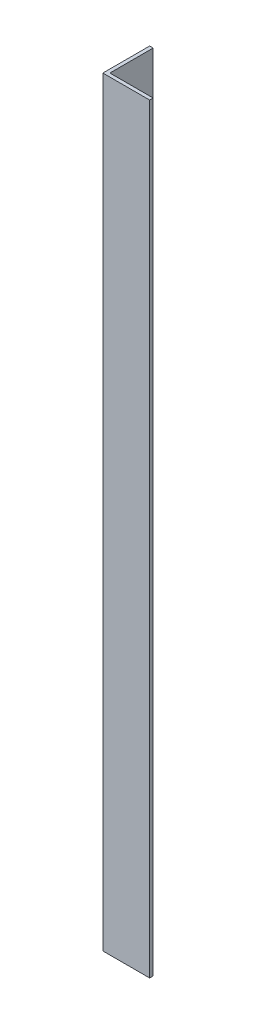
ISO-10303-21;
HEADER;
FILE_DESCRIPTION(('STEP AP214'),'2;1');
FILE_NAME('part.step','',(''),(''),'','','');
FILE_SCHEMA(('AUTOMOTIVE_DESIGN { 1 0 10303 214 1 1 1 1 }'));
ENDSEC;
DATA;
#1=APPLICATION_CONTEXT('core data for automotive mechanical design processes');
#2=APPLICATION_PROTOCOL_DEFINITION('international standard','automotive_design',2000,#1);
#3=PRODUCT_CONTEXT('',#1,'mechanical');
#4=PRODUCT('Part','Part','',(#3));
#5=PRODUCT_RELATED_PRODUCT_CATEGORY('part','',(#4));
#6=PRODUCT_DEFINITION_FORMATION('','',#4);
#7=PRODUCT_DEFINITION_CONTEXT('part definition',#1,'design');
#8=PRODUCT_DEFINITION('design','',#6,#7);
#9=PRODUCT_DEFINITION_SHAPE('','',#8);
#10=(LENGTH_UNIT() NAMED_UNIT(*) SI_UNIT(.MILLI.,.METRE.));
#11=(NAMED_UNIT(*) PLANE_ANGLE_UNIT() SI_UNIT($,.RADIAN.));
#12=(NAMED_UNIT(*) SI_UNIT($,.STERADIAN.) SOLID_ANGLE_UNIT());
#13=UNCERTAINTY_MEASURE_WITH_UNIT(LENGTH_MEASURE(1.E-05),#10,'distance_accuracy_value','');
#14=(GEOMETRIC_REPRESENTATION_CONTEXT(3) GLOBAL_UNCERTAINTY_ASSIGNED_CONTEXT((#13)) GLOBAL_UNIT_ASSIGNED_CONTEXT((#10,
#11,#12)) REPRESENTATION_CONTEXT('',''));
#15=CARTESIAN_POINT('',(0.,0.,0.));
#16=DIRECTION('',(0.,0.,1.));
#17=DIRECTION('',(1.,0.,0.));
#18=AXIS2_PLACEMENT_3D('',#15,#16,#17);
#19=CARTESIAN_POINT('',(0.,650.,0.));
#20=DIRECTION('',(0.,0.,-1.));
#21=DIRECTION('',(-1.,0.,0.));
#22=AXIS2_PLACEMENT_3D('',#19,#20,#21);
#23=PLANE('',#22);
#24=DIRECTION('',(1.,0.,0.));
#25=VECTOR('',#24,1.);
#26=CARTESIAN_POINT('',(0.,0.,0.));
#27=LINE('',#26,#25);
#28=CARTESIAN_POINT('',(0.,0.,0.));
#29=VERTEX_POINT('',#28);
#30=CARTESIAN_POINT('',(40.,0.,0.));
#31=VERTEX_POINT('',#30);
#32=EDGE_CURVE('E115',#29,#31,#27,.T.);
#33=ORIENTED_EDGE('',*,*,#32,.T.);
#34=DIRECTION('',(0.,-1.,0.));
#35=VECTOR('',#34,1.);
#36=CARTESIAN_POINT('',(40.,650.,0.));
#37=LINE('',#36,#35);
#38=CARTESIAN_POINT('',(40.,650.,0.));
#39=VERTEX_POINT('',#38);
#40=EDGE_CURVE('E11',#39,#31,#37,.T.);
#41=ORIENTED_EDGE('',*,*,#40,.F.);
#42=DIRECTION('',(1.,0.,0.));
#43=VECTOR('',#42,1.);
#44=CARTESIAN_POINT('',(0.,650.,0.));
#45=LINE('',#44,#43);
#46=CARTESIAN_POINT('',(0.,650.,0.));
#47=VERTEX_POINT('',#46);
#48=EDGE_CURVE('E80',#47,#39,#45,.T.);
#49=ORIENTED_EDGE('',*,*,#48,.F.);
#50=DIRECTION('',(0.,-1.,0.));
#51=VECTOR('',#50,1.);
#52=CARTESIAN_POINT('',(0.,650.,0.));
#53=LINE('',#52,#51);
#54=EDGE_CURVE('E111',#47,#29,#53,.T.);
#55=ORIENTED_EDGE('',*,*,#54,.T.);
#56=EDGE_LOOP('',(#33,#41,#49,#55));
#57=FACE_BOUND('',#56,.T.);
#58=ADVANCED_FACE('F34',(#57),#23,.F.);
#59=CARTESIAN_POINT('',(40.,650.,-3.));
#60=DIRECTION('',(1.,0.,0.));
#61=DIRECTION('',(0.,0.,-1.));
#62=AXIS2_PLACEMENT_3D('',#59,#60,#61);
#63=PLANE('',#62);
#64=DIRECTION('',(0.,0.,1.));
#65=VECTOR('',#64,1.);
#66=CARTESIAN_POINT('',(40.,0.,-3.));
#67=LINE('',#66,#65);
#68=CARTESIAN_POINT('',(40.,0.,-3.));
#69=VERTEX_POINT('',#68);
#70=EDGE_CURVE('E118',#69,#31,#67,.T.);
#71=ORIENTED_EDGE('',*,*,#70,.F.);
#72=DIRECTION('',(0.,-1.,0.));
#73=VECTOR('',#72,1.);
#74=CARTESIAN_POINT('',(40.,650.,-3.));
#75=LINE('',#74,#73);
#76=CARTESIAN_POINT('',(40.,650.,-3.));
#77=VERTEX_POINT('',#76);
#78=EDGE_CURVE('E42',#77,#69,#75,.T.);
#79=ORIENTED_EDGE('',*,*,#78,.F.);
#80=DIRECTION('',(0.,0.,1.));
#81=VECTOR('',#80,1.);
#82=CARTESIAN_POINT('',(40.,650.,-3.));
#83=LINE('',#82,#81);
#84=EDGE_CURVE('E204',#77,#39,#83,.T.);
#85=ORIENTED_EDGE('',*,*,#84,.T.);
#86=ORIENTED_EDGE('',*,*,#40,.T.);
#87=EDGE_LOOP('',(#71,#79,#85,#86));
#88=FACE_BOUND('',#87,.T.);
#89=ADVANCED_FACE('F136',(#88),#63,.T.);
#90=CARTESIAN_POINT('',(0.,650.,-3.));
#91=DIRECTION('',(0.,0.,-1.));
#92=DIRECTION('',(-1.,0.,0.));
#93=AXIS2_PLACEMENT_3D('',#90,#91,#92);
#94=PLANE('',#93);
#95=DIRECTION('',(1.,0.,0.));
#96=VECTOR('',#95,1.);
#97=CARTESIAN_POINT('',(0.,0.,-3.));
#98=LINE('',#97,#96);
#99=CARTESIAN_POINT('',(3.,0.,-3.));
#100=VERTEX_POINT('',#99);
#101=EDGE_CURVE('E121',#100,#69,#98,.T.);
#102=ORIENTED_EDGE('',*,*,#101,.F.);
#103=DIRECTION('',(0.,-1.,0.));
#104=VECTOR('',#103,1.);
#105=CARTESIAN_POINT('',(3.,650.,-3.));
#106=LINE('',#105,#104);
#107=CARTESIAN_POINT('',(3.,650.,-3.));
#108=VERTEX_POINT('',#107);
#109=EDGE_CURVE('E101',#108,#100,#106,.T.);
#110=ORIENTED_EDGE('',*,*,#109,.F.);
#111=DIRECTION('',(1.,0.,0.));
#112=VECTOR('',#111,1.);
#113=CARTESIAN_POINT('',(0.,650.,-3.));
#114=LINE('',#113,#112);
#115=EDGE_CURVE('E107',#108,#77,#114,.T.);
#116=ORIENTED_EDGE('',*,*,#115,.T.);
#117=ORIENTED_EDGE('',*,*,#78,.T.);
#118=EDGE_LOOP('',(#102,#110,#116,#117));
#119=FACE_BOUND('',#118,.T.);
#120=ADVANCED_FACE('F133',(#119),#94,.T.);
#121=CARTESIAN_POINT('',(3.,650.,-40.));
#122=DIRECTION('',(1.,0.,0.));
#123=DIRECTION('',(0.,0.,-1.));
#124=AXIS2_PLACEMENT_3D('',#121,#122,#123);
#125=PLANE('',#124);
#126=DIRECTION('',(0.,0.,1.));
#127=VECTOR('',#126,1.);
#128=CARTESIAN_POINT('',(3.,0.,-40.));
#129=LINE('',#128,#127);
#130=CARTESIAN_POINT('',(3.,0.,-40.));
#131=VERTEX_POINT('',#130);
#132=EDGE_CURVE('E96',#131,#100,#129,.T.);
#133=ORIENTED_EDGE('',*,*,#132,.F.);
#134=DIRECTION('',(0.,-1.,0.));
#135=VECTOR('',#134,1.);
#136=CARTESIAN_POINT('',(3.,650.,-40.));
#137=LINE('',#136,#135);
#138=CARTESIAN_POINT('',(3.,650.,-40.));
#139=VERTEX_POINT('',#138);
#140=EDGE_CURVE('E91',#139,#131,#137,.T.);
#141=ORIENTED_EDGE('',*,*,#140,.F.);
#142=DIRECTION('',(0.,0.,1.));
#143=VECTOR('',#142,1.);
#144=CARTESIAN_POINT('',(3.,650.,-40.));
#145=LINE('',#144,#143);
#146=EDGE_CURVE('E94',#139,#108,#145,.T.);
#147=ORIENTED_EDGE('',*,*,#146,.T.);
#148=ORIENTED_EDGE('',*,*,#109,.T.);
#149=EDGE_LOOP('',(#133,#141,#147,#148));
#150=FACE_BOUND('',#149,.T.);
#151=ADVANCED_FACE('F93',(#150),#125,.T.);
#152=CARTESIAN_POINT('',(0.,650.,-40.));
#153=DIRECTION('',(0.,0.,-1.));
#154=DIRECTION('',(-1.,0.,0.));
#155=AXIS2_PLACEMENT_3D('',#152,#153,#154);
#156=PLANE('',#155);
#157=DIRECTION('',(1.,0.,0.));
#158=VECTOR('',#157,1.);
#159=CARTESIAN_POINT('',(0.,0.,-40.));
#160=LINE('',#159,#158);
#161=CARTESIAN_POINT('',(0.,0.,-40.));
#162=VERTEX_POINT('',#161);
#163=EDGE_CURVE('E125',#162,#131,#160,.T.);
#164=ORIENTED_EDGE('',*,*,#163,.F.);
#165=DIRECTION('',(0.,-1.,0.));
#166=VECTOR('',#165,1.);
#167=CARTESIAN_POINT('',(0.,650.,-40.));
#168=LINE('',#167,#166);
#169=CARTESIAN_POINT('',(0.,650.,-40.));
#170=VERTEX_POINT('',#169);
#171=EDGE_CURVE('E71',#170,#162,#168,.T.);
#172=ORIENTED_EDGE('',*,*,#171,.F.);
#173=DIRECTION('',(1.,0.,0.));
#174=VECTOR('',#173,1.);
#175=CARTESIAN_POINT('',(0.,650.,-40.));
#176=LINE('',#175,#174);
#177=EDGE_CURVE('E105',#170,#139,#176,.T.);
#178=ORIENTED_EDGE('',*,*,#177,.T.);
#179=ORIENTED_EDGE('',*,*,#140,.T.);
#180=EDGE_LOOP('',(#164,#172,#178,#179));
#181=FACE_BOUND('',#180,.T.);
#182=ADVANCED_FACE('F109',(#181),#156,.T.);
#183=CARTESIAN_POINT('',(0.,650.,-40.));
#184=DIRECTION('',(1.,0.,0.));
#185=DIRECTION('',(0.,0.,-1.));
#186=AXIS2_PLACEMENT_3D('',#183,#184,#185);
#187=PLANE('',#186);
#188=DIRECTION('',(0.,0.,1.));
#189=VECTOR('',#188,1.);
#190=CARTESIAN_POINT('',(0.,0.,-40.));
#191=LINE('',#190,#189);
#192=EDGE_CURVE('E74',#162,#29,#191,.T.);
#193=ORIENTED_EDGE('',*,*,#192,.T.);
#194=ORIENTED_EDGE('',*,*,#54,.F.);
#195=DIRECTION('',(0.,0.,1.));
#196=VECTOR('',#195,1.);
#197=CARTESIAN_POINT('',(0.,650.,-40.));
#198=LINE('',#197,#196);
#199=EDGE_CURVE('E50',#170,#47,#198,.T.);
#200=ORIENTED_EDGE('',*,*,#199,.F.);
#201=ORIENTED_EDGE('',*,*,#171,.T.);
#202=EDGE_LOOP('',(#193,#194,#200,#201));
#203=FACE_BOUND('',#202,.T.);
#204=ADVANCED_FACE('F141',(#203),#187,.F.);
#205=CARTESIAN_POINT('',(0.,650.,0.));
#206=DIRECTION('',(0.,-1.,0.));
#207=DIRECTION('',(-1.,0.,0.));
#208=AXIS2_PLACEMENT_3D('',#205,#206,#207);
#209=PLANE('',#208);
#210=ORIENTED_EDGE('',*,*,#48,.T.);
#211=ORIENTED_EDGE('',*,*,#84,.F.);
#212=ORIENTED_EDGE('',*,*,#115,.F.);
#213=ORIENTED_EDGE('',*,*,#146,.F.);
#214=ORIENTED_EDGE('',*,*,#177,.F.);
#215=ORIENTED_EDGE('',*,*,#199,.T.);
#216=EDGE_LOOP('',(#210,#211,#212,#213,#214,#215));
#217=FACE_BOUND('',#216,.T.);
#218=ADVANCED_FACE('F104',(#217),#209,.F.);
#219=CARTESIAN_POINT('',(0.,0.,0.));
#220=DIRECTION('',(0.,-1.,0.));
#221=DIRECTION('',(-1.,0.,0.));
#222=AXIS2_PLACEMENT_3D('',#219,#220,#221);
#223=PLANE('',#222);
#224=ORIENTED_EDGE('',*,*,#32,.F.);
#225=ORIENTED_EDGE('',*,*,#192,.F.);
#226=ORIENTED_EDGE('',*,*,#163,.T.);
#227=ORIENTED_EDGE('',*,*,#132,.T.);
#228=ORIENTED_EDGE('',*,*,#101,.T.);
#229=ORIENTED_EDGE('',*,*,#70,.T.);
#230=EDGE_LOOP('',(#224,#225,#226,#227,#228,#229));
#231=FACE_BOUND('',#230,.T.);
#232=ADVANCED_FACE('F139',(#231),#223,.T.);
#233=CLOSED_SHELL('',(#58,#89,#120,#151,#182,#204,#218,#232));
#234=MANIFOLD_SOLID_BREP('B2',#233);
#235=ADVANCED_BREP_SHAPE_REPRESENTATION('',(#18,#234),#14);
#236=SHAPE_DEFINITION_REPRESENTATION(#9,#235);
ENDSEC;
END-ISO-10303-21;
